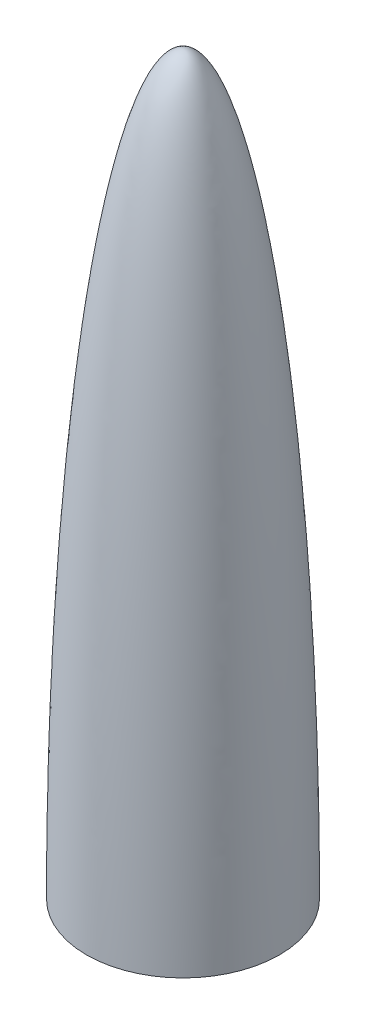
ISO-10303-21;
HEADER;
FILE_DESCRIPTION(('STEP AP214'),'2;1');
FILE_NAME('part.step','',(''),(''),'','','');
FILE_SCHEMA(('AUTOMOTIVE_DESIGN { 1 0 10303 214 1 1 1 1 }'));
ENDSEC;
DATA;
#1=APPLICATION_CONTEXT('core data for automotive mechanical design processes');
#2=APPLICATION_PROTOCOL_DEFINITION('international standard','automotive_design',2000,#1);
#3=PRODUCT_CONTEXT('',#1,'mechanical');
#4=PRODUCT('Part','Part','',(#3));
#5=PRODUCT_RELATED_PRODUCT_CATEGORY('part','',(#4));
#6=PRODUCT_DEFINITION_FORMATION('','',#4);
#7=PRODUCT_DEFINITION_CONTEXT('part definition',#1,'design');
#8=PRODUCT_DEFINITION('design','',#6,#7);
#9=PRODUCT_DEFINITION_SHAPE('','',#8);
#10=(LENGTH_UNIT() NAMED_UNIT(*) SI_UNIT(.MILLI.,.METRE.));
#11=(NAMED_UNIT(*) PLANE_ANGLE_UNIT() SI_UNIT($,.RADIAN.));
#12=(NAMED_UNIT(*) SI_UNIT($,.STERADIAN.) SOLID_ANGLE_UNIT());
#13=UNCERTAINTY_MEASURE_WITH_UNIT(LENGTH_MEASURE(1.E-05),#10,'distance_accuracy_value','');
#14=(GEOMETRIC_REPRESENTATION_CONTEXT(3) GLOBAL_UNCERTAINTY_ASSIGNED_CONTEXT((#13)) GLOBAL_UNIT_ASSIGNED_CONTEXT((#10,
#11,#12)) REPRESENTATION_CONTEXT('',''));
#15=CARTESIAN_POINT('',(0.,0.,0.));
#16=DIRECTION('',(0.,0.,1.));
#17=DIRECTION('',(1.,0.,0.));
#18=AXIS2_PLACEMENT_3D('',#15,#16,#17);
#19=CARTESIAN_POINT('',(38.8,0.,0.));
#20=CARTESIAN_POINT('',(38.8,9.96011632017647,0.));
#21=CARTESIAN_POINT('',(38.671450180009,29.9351778252176,0.));
#22=CARTESIAN_POINT('',(38.0948593433429,59.565075973522,0.));
#23=CARTESIAN_POINT('',(37.1400283825238,88.6320459989924,0.));
#24=CARTESIAN_POINT('',(35.3751887665411,126.244633967366,0.));
#25=CARTESIAN_POINT('',(32.2773790409416,170.438391327048,0.));
#26=CARTESIAN_POINT('',(27.2759263291695,216.905551347941,0.));
#27=CARTESIAN_POINT('',(22.2007164772128,248.658065047664,0.));
#28=CARTESIAN_POINT('',(17.7193554956905,269.13570320134,0.));
#29=CARTESIAN_POINT('',(14.1848247698659,281.87992499457,0.));
#30=CARTESIAN_POINT('',(10.5212093733357,291.870823580998,0.));
#31=CARTESIAN_POINT('',(7.41174845349992,297.795449319711,0.));
#32=CARTESIAN_POINT('',(4.95992086566168,301.030943250474,0.));
#33=CARTESIAN_POINT('',(3.1827508411617,302.695869879397,0.));
#34=CARTESIAN_POINT('',(1.50951692720994,303.616383263463,0.));
#35=CARTESIAN_POINT('',(0.52300236754581,303.8,0.));
#36=CARTESIAN_POINT('',(0.,303.8,0.));
#37=B_SPLINE_CURVE_WITH_KNOTS('',3,(#19,#20,#21,#22,#23,#24,#25,#26,#27,#28,#29,#30,#31,#32,#33,
#34,#35,#36),.UNSPECIFIED.,.F.,.F.,(4,1,1,1,1,1,1,1,1,1,1,1,1,1,1,4),(-1.5707963267949,
-1.47262155637022,-1.37444678594553,-1.27627201552085,-1.17809724509617,-0.98174770424681,
-0.785398163397448,-0.589048622548086,-0.490873852123405,-0.392699081698724,-0.294524311274043,
-0.196349540849362,-0.147262155637022,-0.098174770424681,-0.0490873852123405,0.),.UNSPECIFIED.);
#38=CARTESIAN_POINT('',(0.,0.,0.));
#39=DIRECTION('',(0.,-1.,0.));
#40=AXIS1_PLACEMENT('',#38,#39);
#41=SURFACE_OF_REVOLUTION('',#37,#40);
#42=CARTESIAN_POINT('',(0.,303.8,0.));
#43=VERTEX_POINT('',#42);
#44=VERTEX_LOOP('',#43);
#45=FACE_BOUND('',#44,.T.);
#46=CARTESIAN_POINT('',(0.,0.,0.));
#47=DIRECTION('',(0.,-1.,0.));
#48=DIRECTION('',(1.,0.,0.));
#49=AXIS2_PLACEMENT_3D('',#46,#47,#48);
#50=CIRCLE('',#49,38.8);
#51=CARTESIAN_POINT('',(38.8,0.,0.));
#52=VERTEX_POINT('',#51);
#53=EDGE_CURVE('E11',#52,#52,#50,.T.);
#54=ORIENTED_EDGE('',*,*,#53,.T.);
#55=EDGE_LOOP('',(#54));
#56=FACE_BOUND('',#55,.T.);
#57=ADVANCED_FACE('F45',(#45,#56),#41,.T.);
#58=CARTESIAN_POINT('',(0.,0.,0.));
#59=DIRECTION('',(0.,1.,0.));
#60=DIRECTION('',(-1.,0.,0.));
#61=AXIS2_PLACEMENT_3D('',#58,#59,#60);
#62=PLANE('',#61);
#63=ORIENTED_EDGE('',*,*,#53,.F.);
#64=EDGE_LOOP('',(#63));
#65=FACE_BOUND('',#64,.T.);
#66=CARTESIAN_POINT('',(0.,0.,0.));
#67=DIRECTION('',(0.,-1.,0.));
#68=DIRECTION('',(1.,0.,0.));
#69=AXIS2_PLACEMENT_3D('',#66,#67,#68);
#70=CIRCLE('',#69,40.);
#71=CARTESIAN_POINT('',(40.,0.,0.));
#72=VERTEX_POINT('',#71);
#73=EDGE_CURVE('E54',#72,#72,#70,.T.);
#74=ORIENTED_EDGE('',*,*,#73,.T.);
#75=EDGE_LOOP('',(#74));
#76=FACE_BOUND('',#75,.T.);
#77=ADVANCED_FACE('F63',(#65,#76),#62,.F.);
#78=CARTESIAN_POINT('',(0.,0.,0.));
#79=DIRECTION('',(0.,0.,1.));
#80=DIRECTION('',(0.,1.,0.));
#81=AXIS2_PLACEMENT_3D('',#78,#79,#80);
#82=ELLIPSE('',#81,305.,40.);
#83=TRIMMED_CURVE('',#82,(PARAMETER_VALUE(3.14159265358979)),
(PARAMETER_VALUE(6.28318530717959)),.T.,.PARAMETER.);
#84=CARTESIAN_POINT('',(0.,0.,0.));
#85=DIRECTION('',(0.,-1.,0.));
#86=AXIS1_PLACEMENT('',#84,#85);
#87=SURFACE_OF_REVOLUTION('',#83,#86);
#88=CARTESIAN_POINT('',(0.,305.,0.));
#89=VERTEX_POINT('',#88);
#90=VERTEX_LOOP('',#89);
#91=FACE_BOUND('',#90,.T.);
#92=ORIENTED_EDGE('',*,*,#73,.F.);
#93=EDGE_LOOP('',(#92));
#94=FACE_BOUND('',#93,.T.);
#95=ADVANCED_FACE('F60',(#91,#94),#87,.F.);
#96=CLOSED_SHELL('',(#57,#77,#95));
#97=MANIFOLD_SOLID_BREP('B2',#96);
#98=ADVANCED_BREP_SHAPE_REPRESENTATION('',(#18,#97),#14);
#99=SHAPE_DEFINITION_REPRESENTATION(#9,#98);
ENDSEC;
END-ISO-10303-21;
